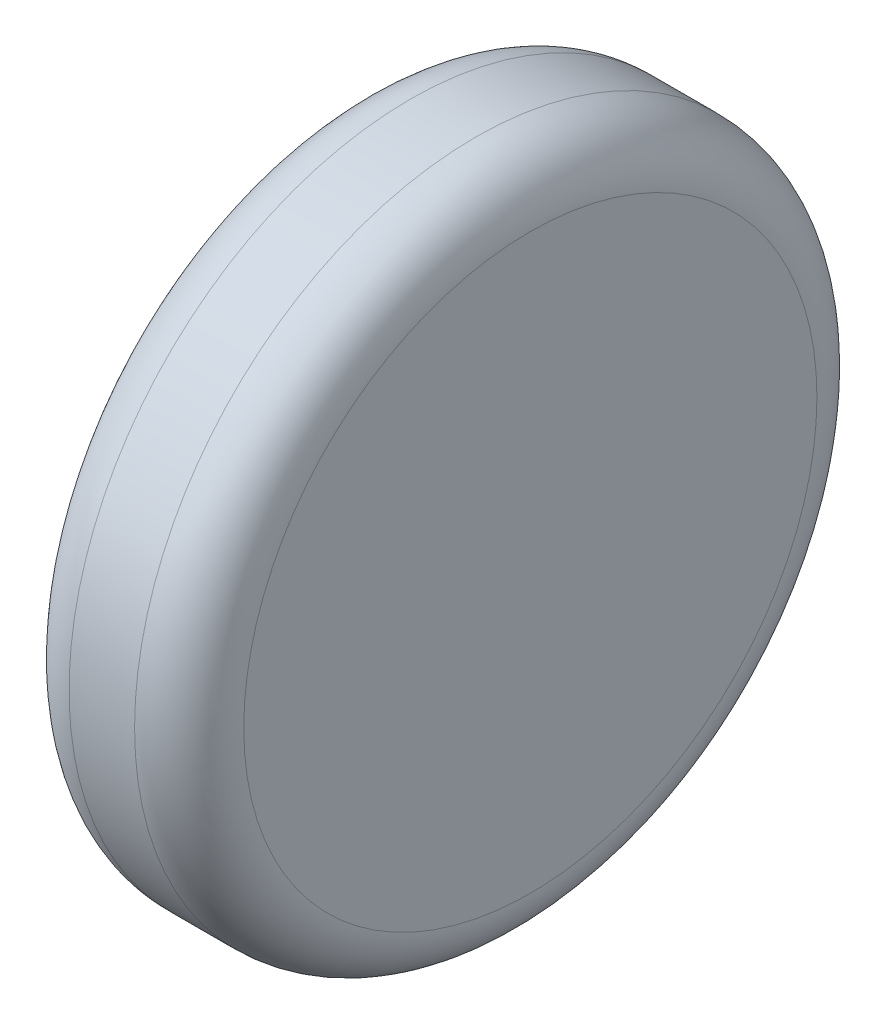
ISO-10303-21;
HEADER;
FILE_DESCRIPTION(('STEP AP214'),'2;1');
FILE_NAME('part.step','',(''),(''),'','','');
FILE_SCHEMA(('AUTOMOTIVE_DESIGN { 1 0 10303 214 1 1 1 1 }'));
ENDSEC;
DATA;
#1=APPLICATION_CONTEXT('core data for automotive mechanical design processes');
#2=APPLICATION_PROTOCOL_DEFINITION('international standard','automotive_design',2000,#1);
#3=PRODUCT_CONTEXT('',#1,'mechanical');
#4=PRODUCT('Part','Part','',(#3));
#5=PRODUCT_RELATED_PRODUCT_CATEGORY('part','',(#4));
#6=PRODUCT_DEFINITION_FORMATION('','',#4);
#7=PRODUCT_DEFINITION_CONTEXT('part definition',#1,'design');
#8=PRODUCT_DEFINITION('design','',#6,#7);
#9=PRODUCT_DEFINITION_SHAPE('','',#8);
#10=(LENGTH_UNIT() NAMED_UNIT(*) SI_UNIT(.MILLI.,.METRE.));
#11=(NAMED_UNIT(*) PLANE_ANGLE_UNIT() SI_UNIT($,.RADIAN.));
#12=(NAMED_UNIT(*) SI_UNIT($,.STERADIAN.) SOLID_ANGLE_UNIT());
#13=UNCERTAINTY_MEASURE_WITH_UNIT(LENGTH_MEASURE(1.E-05),#10,'distance_accuracy_value','');
#14=(GEOMETRIC_REPRESENTATION_CONTEXT(3) GLOBAL_UNCERTAINTY_ASSIGNED_CONTEXT((#13)) GLOBAL_UNIT_ASSIGNED_CONTEXT((#10,
#11,#12)) REPRESENTATION_CONTEXT('',''));
#15=CARTESIAN_POINT('',(0.,0.,0.));
#16=DIRECTION('',(0.,0.,1.));
#17=DIRECTION('',(1.,0.,0.));
#18=AXIS2_PLACEMENT_3D('',#15,#16,#17);
#19=CARTESIAN_POINT('',(-1.06536428530938,-0.332340218761648,0.1012));
#20=DIRECTION('',(1.,0.,0.));
#21=DIRECTION('',(0.,1.,0.));
#22=AXIS2_PLACEMENT_3D('',#19,#20,#21);
#23=PLANE('',#22);
#24=CARTESIAN_POINT('',(-1.06536428530938,-0.332340218761648,0.1012));
#25=DIRECTION('',(1.,0.,0.));
#26=DIRECTION('',(0.,0.,-1.));
#27=AXIS2_PLACEMENT_3D('',#24,#25,#26);
#28=CIRCLE('',#27,0.0262499999999999);
#29=CARTESIAN_POINT('',(-1.06536428530938,-0.332340218761648,0.0749500000000001));
#30=VERTEX_POINT('',#29);
#31=CARTESIAN_POINT('',(-1.06536428530938,-0.306090218761648,0.1012));
#32=VERTEX_POINT('',#31);
#33=EDGE_CURVE('E55',#30,#32,#28,.T.);
#34=ORIENTED_EDGE('',*,*,#33,.F.);
#35=CARTESIAN_POINT('',(-1.06536428530938,-0.332340218761648,0.1012));
#36=DIRECTION('',(1.,0.,0.));
#37=DIRECTION('',(0.,0.,1.));
#38=AXIS2_PLACEMENT_3D('',#35,#36,#37);
#39=CIRCLE('',#38,0.02625);
#40=CARTESIAN_POINT('',(-1.06536428530938,-0.332340218761648,0.12745));
#41=VERTEX_POINT('',#40);
#42=EDGE_CURVE('E49',#41,#30,#39,.T.);
#43=ORIENTED_EDGE('',*,*,#42,.F.);
#44=CARTESIAN_POINT('',(-1.06536428530938,-0.332340218761648,0.1012));
#45=DIRECTION('',(1.,0.,0.));
#46=DIRECTION('',(0.,1.,0.));
#47=AXIS2_PLACEMENT_3D('',#44,#45,#46);
#48=CIRCLE('',#47,0.02625);
#49=EDGE_CURVE('E53',#32,#41,#48,.T.);
#50=ORIENTED_EDGE('',*,*,#49,.F.);
#51=EDGE_LOOP('',(#34,#43,#50));
#52=FACE_BOUND('',#51,.T.);
#53=ADVANCED_FACE('F17',(#52),#23,.F.);
#54=CARTESIAN_POINT('',(-1.06036428530938,-0.332340218761648,0.1012));
#55=DIRECTION('',(1.,0.,0.));
#56=DIRECTION('',(0.,0.,1.));
#57=AXIS2_PLACEMENT_3D('',#54,#55,#56);
#58=TOROIDAL_SURFACE('',#57,0.02625,0.005);
#59=CARTESIAN_POINT('',(-1.06036428530938,-0.332340218761648,0.1012));
#60=DIRECTION('',(1.,0.,0.));
#61=DIRECTION('',(0.,1.,0.));
#62=AXIS2_PLACEMENT_3D('',#59,#60,#61);
#63=CIRCLE('',#62,0.03125);
#64=CARTESIAN_POINT('',(-1.06036428530938,-0.301090218761648,0.1012));
#65=VERTEX_POINT('',#64);
#66=EDGE_CURVE('E62',#65,#65,#63,.T.);
#67=ORIENTED_EDGE('',*,*,#66,.F.);
#68=EDGE_LOOP('',(#67));
#69=FACE_BOUND('',#68,.T.);
#70=ORIENTED_EDGE('',*,*,#33,.T.);
#71=ORIENTED_EDGE('',*,*,#49,.T.);
#72=ORIENTED_EDGE('',*,*,#42,.T.);
#73=EDGE_LOOP('',(#70,#71,#72));
#74=FACE_BOUND('',#73,.T.);
#75=ADVANCED_FACE('F60',(#69,#74),#58,.T.);
#76=CARTESIAN_POINT('',(-1.04936428530938,-0.332340218761648,0.1012));
#77=DIRECTION('',(1.,0.,0.));
#78=DIRECTION('',(0.,1.,0.));
#79=AXIS2_PLACEMENT_3D('',#76,#77,#78);
#80=CYLINDRICAL_SURFACE('',#79,0.03125);
#81=CARTESIAN_POINT('',(-1.05436428530938,-0.332340218761648,0.1012));
#82=DIRECTION('',(1.,0.,0.));
#83=DIRECTION('',(0.,0.,1.));
#84=AXIS2_PLACEMENT_3D('',#81,#82,#83);
#85=CIRCLE('',#84,0.03125);
#86=CARTESIAN_POINT('',(-1.05436428530938,-0.332340218761648,0.13245));
#87=VERTEX_POINT('',#86);
#88=EDGE_CURVE('E86',#87,#87,#85,.T.);
#89=ORIENTED_EDGE('',*,*,#88,.F.);
#90=EDGE_LOOP('',(#89));
#91=FACE_BOUND('',#90,.T.);
#92=ORIENTED_EDGE('',*,*,#66,.T.);
#93=EDGE_LOOP('',(#92));
#94=FACE_BOUND('',#93,.T.);
#95=ADVANCED_FACE('F79',(#91,#94),#80,.T.);
#96=CARTESIAN_POINT('',(-1.05436428530938,-0.332340218761648,0.1012));
#97=DIRECTION('',(1.,0.,0.));
#98=DIRECTION('',(0.,0.,1.));
#99=AXIS2_PLACEMENT_3D('',#96,#97,#98);
#100=TOROIDAL_SURFACE('',#99,0.02625,0.005);
#101=ORIENTED_EDGE('',*,*,#88,.T.);
#102=EDGE_LOOP('',(#101));
#103=FACE_BOUND('',#102,.T.);
#104=CARTESIAN_POINT('',(-1.04936428530938,-0.332340218761648,0.1012));
#105=DIRECTION('',(-1.,0.,0.));
#106=DIRECTION('',(0.,0.,-1.));
#107=AXIS2_PLACEMENT_3D('',#104,#105,#106);
#108=CIRCLE('',#107,0.0262499999999999);
#109=CARTESIAN_POINT('',(-1.04936428530938,-0.332340218761648,0.12745));
#110=VERTEX_POINT('',#109);
#111=CARTESIAN_POINT('',(-1.04936428530938,-0.332340218761648,0.0749500000000001));
#112=VERTEX_POINT('',#111);
#113=EDGE_CURVE('E11',#110,#112,#108,.F.);
#114=ORIENTED_EDGE('',*,*,#113,.F.);
#115=CARTESIAN_POINT('',(-1.04936428530938,-0.332340218761648,0.1012));
#116=DIRECTION('',(-1.,0.,0.));
#117=DIRECTION('',(0.,0.,1.));
#118=AXIS2_PLACEMENT_3D('',#115,#116,#117);
#119=CIRCLE('',#118,0.02625);
#120=CARTESIAN_POINT('',(-1.04936428530938,-0.306090218761648,0.1012));
#121=VERTEX_POINT('',#120);
#122=EDGE_CURVE('E28',#121,#110,#119,.F.);
#123=ORIENTED_EDGE('',*,*,#122,.F.);
#124=CARTESIAN_POINT('',(-1.04936428530938,-0.332340218761648,0.1012));
#125=DIRECTION('',(-1.,0.,0.));
#126=DIRECTION('',(0.,1.,0.));
#127=AXIS2_PLACEMENT_3D('',#124,#125,#126);
#128=CIRCLE('',#127,0.02625);
#129=EDGE_CURVE('E92',#112,#121,#128,.F.);
#130=ORIENTED_EDGE('',*,*,#129,.F.);
#131=EDGE_LOOP('',(#114,#123,#130));
#132=FACE_BOUND('',#131,.T.);
#133=ADVANCED_FACE('F117',(#103,#132),#100,.T.);
#134=CARTESIAN_POINT('',(-1.04936428530938,-0.332340218761648,0.1012));
#135=DIRECTION('',(1.,0.,0.));
#136=DIRECTION('',(0.,1.,0.));
#137=AXIS2_PLACEMENT_3D('',#134,#135,#136);
#138=PLANE('',#137);
#139=ORIENTED_EDGE('',*,*,#122,.T.);
#140=ORIENTED_EDGE('',*,*,#113,.T.);
#141=ORIENTED_EDGE('',*,*,#129,.T.);
#142=EDGE_LOOP('',(#139,#140,#141));
#143=FACE_BOUND('',#142,.T.);
#144=ADVANCED_FACE('F99',(#143),#138,.T.);
#145=CLOSED_SHELL('',(#53,#75,#95,#133,#144));
#146=MANIFOLD_SOLID_BREP('B1',#145);
#147=ADVANCED_BREP_SHAPE_REPRESENTATION('',(#18,#146),#14);
#148=SHAPE_DEFINITION_REPRESENTATION(#9,#147);
ENDSEC;
END-ISO-10303-21;
